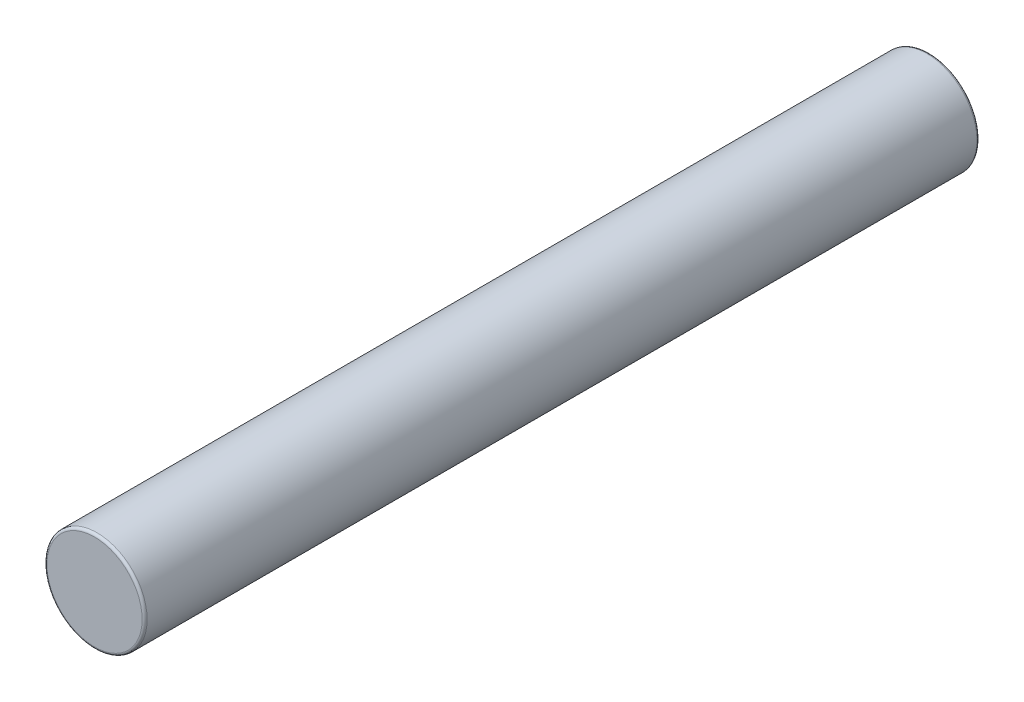
ISO-10303-21;
HEADER;
FILE_DESCRIPTION(('STEP AP214'),'2;1');
FILE_NAME('part.step','',(''),(''),'','','');
FILE_SCHEMA(('AUTOMOTIVE_DESIGN { 1 0 10303 214 1 1 1 1 }'));
ENDSEC;
DATA;
#1=APPLICATION_CONTEXT('core data for automotive mechanical design processes');
#2=APPLICATION_PROTOCOL_DEFINITION('international standard','automotive_design',2000,#1);
#3=PRODUCT_CONTEXT('',#1,'mechanical');
#4=PRODUCT('Part','Part','',(#3));
#5=PRODUCT_RELATED_PRODUCT_CATEGORY('part','',(#4));
#6=PRODUCT_DEFINITION_FORMATION('','',#4);
#7=PRODUCT_DEFINITION_CONTEXT('part definition',#1,'design');
#8=PRODUCT_DEFINITION('design','',#6,#7);
#9=PRODUCT_DEFINITION_SHAPE('','',#8);
#10=(LENGTH_UNIT() NAMED_UNIT(*) SI_UNIT(.MILLI.,.METRE.));
#11=(NAMED_UNIT(*) PLANE_ANGLE_UNIT() SI_UNIT($,.RADIAN.));
#12=(NAMED_UNIT(*) SI_UNIT($,.STERADIAN.) SOLID_ANGLE_UNIT());
#13=UNCERTAINTY_MEASURE_WITH_UNIT(LENGTH_MEASURE(1.E-05),#10,'distance_accuracy_value','');
#14=(GEOMETRIC_REPRESENTATION_CONTEXT(3) GLOBAL_UNCERTAINTY_ASSIGNED_CONTEXT((#13)) GLOBAL_UNIT_ASSIGNED_CONTEXT((#10,
#11,#12)) REPRESENTATION_CONTEXT('',''));
#15=CARTESIAN_POINT('',(0.,0.,0.));
#16=DIRECTION('',(0.,0.,1.));
#17=DIRECTION('',(1.,0.,0.));
#18=AXIS2_PLACEMENT_3D('',#15,#16,#17);
#19=CARTESIAN_POINT('',(0.,0.,-25.));
#20=DIRECTION('',(0.,0.,1.));
#21=DIRECTION('',(1.,0.,0.));
#22=AXIS2_PLACEMENT_3D('',#19,#20,#21);
#23=CYLINDRICAL_SURFACE('',#22,1.5);
#24=CARTESIAN_POINT('',(0.,0.,-0.0749999999999987));
#25=DIRECTION('',(0.,0.,1.));
#26=DIRECTION('',(1.,0.,0.));
#27=AXIS2_PLACEMENT_3D('',#24,#25,#26);
#28=CIRCLE('',#27,1.5);
#29=CARTESIAN_POINT('',(1.5,0.,-0.0749999999999987));
#30=VERTEX_POINT('',#29);
#31=EDGE_CURVE('E42',#30,#30,#28,.F.);
#32=ORIENTED_EDGE('',*,*,#31,.T.);
#33=EDGE_LOOP('',(#32));
#34=FACE_BOUND('',#33,.T.);
#35=CARTESIAN_POINT('',(0.,0.,-24.925));
#36=DIRECTION('',(0.,0.,1.));
#37=DIRECTION('',(1.,0.,0.));
#38=AXIS2_PLACEMENT_3D('',#35,#36,#37);
#39=CIRCLE('',#38,1.5);
#40=CARTESIAN_POINT('',(1.5,0.,-24.925));
#41=VERTEX_POINT('',#40);
#42=EDGE_CURVE('E46',#41,#41,#39,.T.);
#43=ORIENTED_EDGE('',*,*,#42,.T.);
#44=EDGE_LOOP('',(#43));
#45=FACE_BOUND('',#44,.T.);
#46=ADVANCED_FACE('F35',(#34,#45),#23,.T.);
#47=CARTESIAN_POINT('',(0.,0.,-25.));
#48=DIRECTION('',(0.,0.,1.));
#49=DIRECTION('',(1.,0.,0.));
#50=AXIS2_PLACEMENT_3D('',#47,#48,#49);
#51=PLANE('',#50);
#52=CARTESIAN_POINT('',(0.,0.,-25.));
#53=DIRECTION('',(0.,0.,1.));
#54=DIRECTION('',(1.,0.,0.));
#55=AXIS2_PLACEMENT_3D('',#52,#53,#54);
#56=CIRCLE('',#55,1.425);
#57=CARTESIAN_POINT('',(1.425,0.,-25.));
#58=VERTEX_POINT('',#57);
#59=EDGE_CURVE('E10',#58,#58,#56,.F.);
#60=ORIENTED_EDGE('',*,*,#59,.T.);
#61=EDGE_LOOP('',(#60));
#62=FACE_BOUND('',#61,.T.);
#63=ADVANCED_FACE('F66',(#62),#51,.F.);
#64=CARTESIAN_POINT('',(0.,0.,0.));
#65=DIRECTION('',(0.,0.,1.));
#66=DIRECTION('',(1.,0.,0.));
#67=AXIS2_PLACEMENT_3D('',#64,#65,#66);
#68=PLANE('',#67);
#69=CARTESIAN_POINT('',(0.,0.,0.));
#70=DIRECTION('',(0.,0.,1.));
#71=DIRECTION('',(1.,0.,0.));
#72=AXIS2_PLACEMENT_3D('',#69,#70,#71);
#73=CIRCLE('',#72,1.425);
#74=CARTESIAN_POINT('',(1.425,0.,0.));
#75=VERTEX_POINT('',#74);
#76=EDGE_CURVE('E50',#75,#75,#73,.T.);
#77=ORIENTED_EDGE('',*,*,#76,.T.);
#78=EDGE_LOOP('',(#77));
#79=FACE_BOUND('',#78,.T.);
#80=ADVANCED_FACE('F56',(#79),#68,.T.);
#81=CARTESIAN_POINT('',(0.,0.,-0.0749999999999987));
#82=DIRECTION('',(0.,0.,1.));
#83=DIRECTION('',(1.,0.,0.));
#84=AXIS2_PLACEMENT_3D('',#81,#82,#83);
#85=TOROIDAL_SURFACE('',#84,1.425,0.075);
#86=ORIENTED_EDGE('',*,*,#31,.F.);
#87=EDGE_LOOP('',(#86));
#88=FACE_BOUND('',#87,.T.);
#89=ORIENTED_EDGE('',*,*,#76,.F.);
#90=EDGE_LOOP('',(#89));
#91=FACE_BOUND('',#90,.T.);
#92=ADVANCED_FACE('F58',(#88,#91),#85,.T.);
#93=CARTESIAN_POINT('',(0.,0.,-24.925));
#94=DIRECTION('',(0.,0.,1.));
#95=DIRECTION('',(1.,0.,0.));
#96=AXIS2_PLACEMENT_3D('',#93,#94,#95);
#97=TOROIDAL_SURFACE('',#96,1.425,0.075);
#98=ORIENTED_EDGE('',*,*,#59,.F.);
#99=EDGE_LOOP('',(#98));
#100=FACE_BOUND('',#99,.T.);
#101=ORIENTED_EDGE('',*,*,#42,.F.);
#102=EDGE_LOOP('',(#101));
#103=FACE_BOUND('',#102,.T.);
#104=ADVANCED_FACE('F37',(#100,#103),#97,.T.);
#105=CLOSED_SHELL('',(#46,#63,#80,#92,#104));
#106=MANIFOLD_SOLID_BREP('B2',#105);
#107=ADVANCED_BREP_SHAPE_REPRESENTATION('',(#18,#106),#14);
#108=SHAPE_DEFINITION_REPRESENTATION(#9,#107);
ENDSEC;
END-ISO-10303-21;
